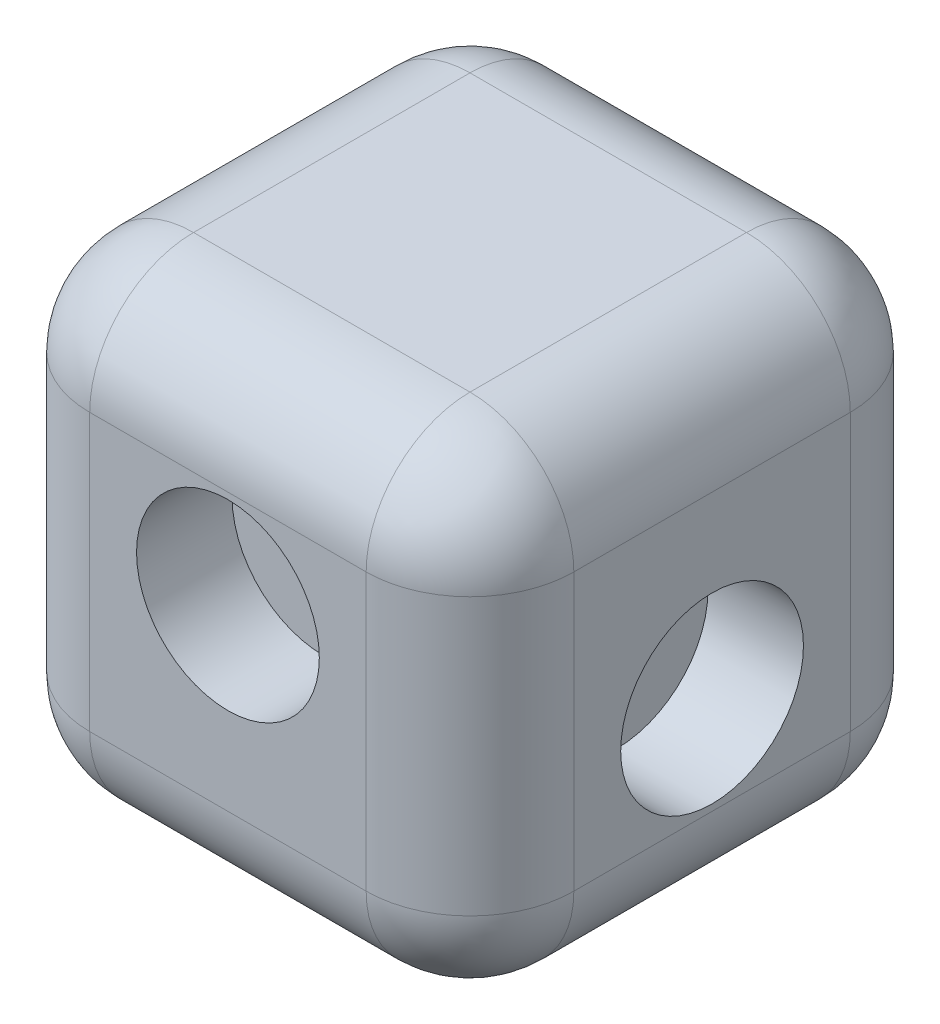
ISO-10303-21;
HEADER;
FILE_DESCRIPTION(('STEP AP214'),'2;1');
FILE_NAME('part.step','',(''),(''),'','','');
FILE_SCHEMA(('AUTOMOTIVE_DESIGN { 1 0 10303 214 1 1 1 1 }'));
ENDSEC;
DATA;
#1=APPLICATION_CONTEXT('core data for automotive mechanical design processes');
#2=APPLICATION_PROTOCOL_DEFINITION('international standard','automotive_design',2000,#1);
#3=PRODUCT_CONTEXT('',#1,'mechanical');
#4=PRODUCT('Part','Part','',(#3));
#5=PRODUCT_RELATED_PRODUCT_CATEGORY('part','',(#4));
#6=PRODUCT_DEFINITION_FORMATION('','',#4);
#7=PRODUCT_DEFINITION_CONTEXT('part definition',#1,'design');
#8=PRODUCT_DEFINITION('design','',#6,#7);
#9=PRODUCT_DEFINITION_SHAPE('','',#8);
#10=(LENGTH_UNIT() NAMED_UNIT(*) SI_UNIT(.MILLI.,.METRE.));
#11=(NAMED_UNIT(*) PLANE_ANGLE_UNIT() SI_UNIT($,.RADIAN.));
#12=(NAMED_UNIT(*) SI_UNIT($,.STERADIAN.) SOLID_ANGLE_UNIT());
#13=UNCERTAINTY_MEASURE_WITH_UNIT(LENGTH_MEASURE(1.E-05),#10,'distance_accuracy_value','');
#14=(GEOMETRIC_REPRESENTATION_CONTEXT(3) GLOBAL_UNCERTAINTY_ASSIGNED_CONTEXT((#13)) GLOBAL_UNIT_ASSIGNED_CONTEXT((#10,
#11,#12)) REPRESENTATION_CONTEXT('',''));
#15=CARTESIAN_POINT('',(0.,0.,0.));
#16=DIRECTION('',(0.,0.,1.));
#17=DIRECTION('',(1.,0.,0.));
#18=AXIS2_PLACEMENT_3D('',#15,#16,#17);
#19=CARTESIAN_POINT('',(0.,8.45184999999999,-8.45185));
#20=DIRECTION('',(-1.,0.,0.));
#21=DIRECTION('',(0.,0.,1.));
#22=AXIS2_PLACEMENT_3D('',#19,#20,#21);
#23=CYLINDRICAL_SURFACE('',#22,6.35);
#24=CARTESIAN_POINT('',(8.45184999999999,8.45184999999999,-8.45185));
#25=DIRECTION('',(1.,0.,0.));
#26=DIRECTION('',(0.,0.,-1.));
#27=AXIS2_PLACEMENT_3D('',#24,#25,#26);
#28=CIRCLE('',#27,6.35);
#29=CARTESIAN_POINT('',(8.45184999999999,8.45184999999999,-14.80185));
#30=VERTEX_POINT('',#29);
#31=CARTESIAN_POINT('',(8.45184999999999,14.80185,-8.45185));
#32=VERTEX_POINT('',#31);
#33=EDGE_CURVE('E11',#30,#32,#28,.T.);
#34=ORIENTED_EDGE('',*,*,#33,.F.);
#35=DIRECTION('',(1.,0.,0.));
#36=VECTOR('',#35,1.);
#37=CARTESIAN_POINT('',(0.,8.45184999999999,-14.80185));
#38=LINE('',#37,#36);
#39=CARTESIAN_POINT('',(-8.45185000000001,8.45184999999999,-14.80185));
#40=VERTEX_POINT('',#39);
#41=EDGE_CURVE('E207',#40,#30,#38,.T.);
#42=ORIENTED_EDGE('',*,*,#41,.F.);
#43=CARTESIAN_POINT('',(-8.45185000000001,8.45184999999999,-8.45185));
#44=DIRECTION('',(1.,0.,0.));
#45=DIRECTION('',(0.,0.,-1.));
#46=AXIS2_PLACEMENT_3D('',#43,#44,#45);
#47=CIRCLE('',#46,6.35);
#48=CARTESIAN_POINT('',(-8.45185000000001,14.80185,-8.45185));
#49=VERTEX_POINT('',#48);
#50=EDGE_CURVE('E42',#40,#49,#47,.T.);
#51=ORIENTED_EDGE('',*,*,#50,.T.);
#52=DIRECTION('',(1.,0.,0.));
#53=VECTOR('',#52,1.);
#54=CARTESIAN_POINT('',(0.,14.80185,-8.45185));
#55=LINE('',#54,#53);
#56=EDGE_CURVE('E130',#32,#49,#55,.F.);
#57=ORIENTED_EDGE('',*,*,#56,.F.);
#58=EDGE_LOOP('',(#34,#42,#51,#57));
#59=FACE_BOUND('',#58,.T.);
#60=ADVANCED_FACE('F35',(#59),#23,.T.);
#61=CARTESIAN_POINT('',(-8.45185000000001,8.45184999999999,-8.45185));
#62=DIRECTION('',(0.,0.,1.));
#63=DIRECTION('',(1.,0.,0.));
#64=AXIS2_PLACEMENT_3D('',#61,#62,#63);
#65=SPHERICAL_SURFACE('',#64,6.35);
#66=ORIENTED_EDGE('',*,*,#50,.F.);
#67=CARTESIAN_POINT('',(-8.45185,8.45184999999999,-8.45185));
#68=DIRECTION('',(0.,1.,0.));
#69=DIRECTION('',(-1.,0.,0.));
#70=AXIS2_PLACEMENT_3D('',#67,#68,#69);
#71=CIRCLE('',#70,6.35);
#72=CARTESIAN_POINT('',(-14.80185,8.45184999999999,-8.45185));
#73=VERTEX_POINT('',#72);
#74=EDGE_CURVE('E55',#40,#73,#71,.T.);
#75=ORIENTED_EDGE('',*,*,#74,.T.);
#76=CARTESIAN_POINT('',(-8.45185000000001,8.45184999999999,-8.45185));
#77=DIRECTION('',(0.,0.,1.));
#78=DIRECTION('',(1.,0.,0.));
#79=AXIS2_PLACEMENT_3D('',#76,#77,#78);
#80=CIRCLE('',#79,6.35);
#81=EDGE_CURVE('E234',#49,#73,#80,.T.);
#82=ORIENTED_EDGE('',*,*,#81,.F.);
#83=EDGE_LOOP('',(#66,#75,#82));
#84=FACE_BOUND('',#83,.T.);
#85=ADVANCED_FACE('F345',(#84),#65,.T.);
#86=CARTESIAN_POINT('',(-8.45185,0.,-8.45185));
#87=DIRECTION('',(0.,-1.,0.));
#88=DIRECTION('',(1.,0.,0.));
#89=AXIS2_PLACEMENT_3D('',#86,#87,#88);
#90=CYLINDRICAL_SURFACE('',#89,6.35);
#91=ORIENTED_EDGE('',*,*,#74,.F.);
#92=DIRECTION('',(0.,1.,0.));
#93=VECTOR('',#92,1.);
#94=CARTESIAN_POINT('',(-8.45185,0.,-14.80185));
#95=LINE('',#94,#93);
#96=CARTESIAN_POINT('',(-8.45185,-8.45185000000001,-14.80185));
#97=VERTEX_POINT('',#96);
#98=EDGE_CURVE('E210',#97,#40,#95,.T.);
#99=ORIENTED_EDGE('',*,*,#98,.F.);
#100=CARTESIAN_POINT('',(-8.45185,-8.45185000000001,-8.45185));
#101=DIRECTION('',(0.,1.,0.));
#102=DIRECTION('',(-1.,0.,0.));
#103=AXIS2_PLACEMENT_3D('',#100,#101,#102);
#104=CIRCLE('',#103,6.35);
#105=CARTESIAN_POINT('',(-14.80185,-8.45185000000001,-8.45185));
#106=VERTEX_POINT('',#105);
#107=EDGE_CURVE('E245',#97,#106,#104,.T.);
#108=ORIENTED_EDGE('',*,*,#107,.T.);
#109=DIRECTION('',(0.,1.,0.));
#110=VECTOR('',#109,1.);
#111=CARTESIAN_POINT('',(-14.80185,0.,-8.45185));
#112=LINE('',#111,#110);
#113=EDGE_CURVE('E231',#73,#106,#112,.F.);
#114=ORIENTED_EDGE('',*,*,#113,.F.);
#115=EDGE_LOOP('',(#91,#99,#108,#114));
#116=FACE_BOUND('',#115,.T.);
#117=ADVANCED_FACE('F250',(#116),#90,.T.);
#118=CARTESIAN_POINT('',(-8.45185,-8.45185000000001,-8.45185));
#119=DIRECTION('',(0.,0.,1.));
#120=DIRECTION('',(1.,0.,0.));
#121=AXIS2_PLACEMENT_3D('',#118,#119,#120);
#122=SPHERICAL_SURFACE('',#121,6.35);
#123=ORIENTED_EDGE('',*,*,#107,.F.);
#124=CARTESIAN_POINT('',(-8.45185,-8.45185000000001,-8.45185));
#125=DIRECTION('',(-1.,0.,0.));
#126=DIRECTION('',(0.,0.,1.));
#127=AXIS2_PLACEMENT_3D('',#124,#125,#126);
#128=CIRCLE('',#127,6.35);
#129=CARTESIAN_POINT('',(-8.45185,-14.80185,-8.45185));
#130=VERTEX_POINT('',#129);
#131=EDGE_CURVE('E243',#97,#130,#128,.T.);
#132=ORIENTED_EDGE('',*,*,#131,.T.);
#133=CARTESIAN_POINT('',(-8.45185,-8.45185000000001,-8.45185));
#134=DIRECTION('',(0.,0.,1.));
#135=DIRECTION('',(1.,0.,0.));
#136=AXIS2_PLACEMENT_3D('',#133,#134,#135);
#137=CIRCLE('',#136,6.35);
#138=EDGE_CURVE('E228',#106,#130,#137,.T.);
#139=ORIENTED_EDGE('',*,*,#138,.F.);
#140=EDGE_LOOP('',(#123,#132,#139));
#141=FACE_BOUND('',#140,.T.);
#142=ADVANCED_FACE('F258',(#141),#122,.T.);
#143=CARTESIAN_POINT('',(0.,-8.45185000000001,-8.45185));
#144=DIRECTION('',(1.,0.,0.));
#145=DIRECTION('',(0.,0.,-1.));
#146=AXIS2_PLACEMENT_3D('',#143,#144,#145);
#147=CYLINDRICAL_SURFACE('',#146,6.35);
#148=ORIENTED_EDGE('',*,*,#131,.F.);
#149=DIRECTION('',(-1.,0.,0.));
#150=VECTOR('',#149,1.);
#151=CARTESIAN_POINT('',(0.,-8.45185000000001,-14.80185));
#152=LINE('',#151,#150);
#153=CARTESIAN_POINT('',(8.45185,-8.45185000000001,-14.80185));
#154=VERTEX_POINT('',#153);
#155=EDGE_CURVE('E213',#154,#97,#152,.T.);
#156=ORIENTED_EDGE('',*,*,#155,.F.);
#157=CARTESIAN_POINT('',(8.45185,-8.45185000000001,-8.45185));
#158=DIRECTION('',(-1.,0.,0.));
#159=DIRECTION('',(0.,0.,1.));
#160=AXIS2_PLACEMENT_3D('',#157,#158,#159);
#161=CIRCLE('',#160,6.35);
#162=CARTESIAN_POINT('',(8.45185,-14.80185,-8.45185));
#163=VERTEX_POINT('',#162);
#164=EDGE_CURVE('E241',#154,#163,#161,.T.);
#165=ORIENTED_EDGE('',*,*,#164,.T.);
#166=DIRECTION('',(-1.,0.,0.));
#167=VECTOR('',#166,1.);
#168=CARTESIAN_POINT('',(0.,-14.80185,-8.45185));
#169=LINE('',#168,#167);
#170=EDGE_CURVE('E225',#130,#163,#169,.F.);
#171=ORIENTED_EDGE('',*,*,#170,.F.);
#172=EDGE_LOOP('',(#148,#156,#165,#171));
#173=FACE_BOUND('',#172,.T.);
#174=ADVANCED_FACE('F354',(#173),#147,.T.);
#175=CARTESIAN_POINT('',(8.45185,-8.45185,-8.45185));
#176=DIRECTION('',(0.,0.,1.));
#177=DIRECTION('',(1.,0.,0.));
#178=AXIS2_PLACEMENT_3D('',#175,#176,#177);
#179=SPHERICAL_SURFACE('',#178,6.35);
#180=ORIENTED_EDGE('',*,*,#164,.F.);
#181=CARTESIAN_POINT('',(8.45185,-8.45185,-8.45185));
#182=DIRECTION('',(0.,-1.,0.));
#183=DIRECTION('',(1.,0.,0.));
#184=AXIS2_PLACEMENT_3D('',#181,#182,#183);
#185=CIRCLE('',#184,6.35);
#186=CARTESIAN_POINT('',(14.80185,-8.45185,-8.45185));
#187=VERTEX_POINT('',#186);
#188=EDGE_CURVE('E239',#154,#187,#185,.T.);
#189=ORIENTED_EDGE('',*,*,#188,.T.);
#190=CARTESIAN_POINT('',(8.45185,-8.45185,-8.45185));
#191=DIRECTION('',(0.,0.,-1.));
#192=DIRECTION('',(-1.,0.,0.));
#193=AXIS2_PLACEMENT_3D('',#190,#191,#192);
#194=CIRCLE('',#193,6.35);
#195=EDGE_CURVE('E222',#163,#187,#194,.F.);
#196=ORIENTED_EDGE('',*,*,#195,.F.);
#197=EDGE_LOOP('',(#180,#189,#196));
#198=FACE_BOUND('',#197,.T.);
#199=ADVANCED_FACE('F389',(#198),#179,.T.);
#200=CARTESIAN_POINT('',(8.45185,0.,-8.45185));
#201=DIRECTION('',(0.,1.,0.));
#202=DIRECTION('',(-1.,0.,0.));
#203=AXIS2_PLACEMENT_3D('',#200,#201,#202);
#204=CYLINDRICAL_SURFACE('',#203,6.35);
#205=ORIENTED_EDGE('',*,*,#188,.F.);
#206=DIRECTION('',(0.,-1.,0.));
#207=VECTOR('',#206,1.);
#208=CARTESIAN_POINT('',(8.45185,0.,-14.80185));
#209=LINE('',#208,#207);
#210=EDGE_CURVE('E216',#30,#154,#209,.T.);
#211=ORIENTED_EDGE('',*,*,#210,.F.);
#212=CARTESIAN_POINT('',(8.45184999999999,8.45184999999999,-8.45185));
#213=DIRECTION('',(0.,-1.,0.));
#214=DIRECTION('',(1.,0.,0.));
#215=AXIS2_PLACEMENT_3D('',#212,#213,#214);
#216=CIRCLE('',#215,6.35);
#217=CARTESIAN_POINT('',(14.80185,8.45185,-8.45185));
#218=VERTEX_POINT('',#217);
#219=EDGE_CURVE('E237',#30,#218,#216,.T.);
#220=ORIENTED_EDGE('',*,*,#219,.T.);
#221=DIRECTION('',(0.,-1.,0.));
#222=VECTOR('',#221,1.);
#223=CARTESIAN_POINT('',(14.80185,0.,-8.45185));
#224=LINE('',#223,#222);
#225=EDGE_CURVE('E219',#187,#218,#224,.F.);
#226=ORIENTED_EDGE('',*,*,#225,.F.);
#227=EDGE_LOOP('',(#205,#211,#220,#226));
#228=FACE_BOUND('',#227,.T.);
#229=ADVANCED_FACE('F286',(#228),#204,.T.);
#230=CARTESIAN_POINT('',(8.45184999999999,8.45184999999999,-8.45185));
#231=DIRECTION('',(0.,0.,1.));
#232=DIRECTION('',(1.,0.,0.));
#233=AXIS2_PLACEMENT_3D('',#230,#231,#232);
#234=SPHERICAL_SURFACE('',#233,6.35);
#235=ORIENTED_EDGE('',*,*,#219,.F.);
#236=ORIENTED_EDGE('',*,*,#33,.T.);
#237=CARTESIAN_POINT('',(8.45184999999999,8.45184999999999,-8.45185));
#238=DIRECTION('',(0.,0.,-1.));
#239=DIRECTION('',(-1.,0.,0.));
#240=AXIS2_PLACEMENT_3D('',#237,#238,#239);
#241=CIRCLE('',#240,6.35);
#242=EDGE_CURVE('E147',#218,#32,#241,.F.);
#243=ORIENTED_EDGE('',*,*,#242,.F.);
#244=EDGE_LOOP('',(#235,#236,#243));
#245=FACE_BOUND('',#244,.T.);
#246=ADVANCED_FACE('F290',(#245),#234,.T.);
#247=CARTESIAN_POINT('',(0.,8.45184999999999,8.45185));
#248=DIRECTION('',(-1.,0.,0.));
#249=DIRECTION('',(0.,0.,1.));
#250=AXIS2_PLACEMENT_3D('',#247,#248,#249);
#251=CYLINDRICAL_SURFACE('',#250,6.35);
#252=CARTESIAN_POINT('',(-8.45185000000001,8.45184999999999,8.45185));
#253=DIRECTION('',(-1.,0.,0.));
#254=DIRECTION('',(0.,0.,1.));
#255=AXIS2_PLACEMENT_3D('',#252,#253,#254);
#256=CIRCLE('',#255,6.35);
#257=CARTESIAN_POINT('',(-8.45185000000001,8.45184999999999,14.80185));
#258=VERTEX_POINT('',#257);
#259=CARTESIAN_POINT('',(-8.45185000000001,14.80185,8.45185));
#260=VERTEX_POINT('',#259);
#261=EDGE_CURVE('E139',#258,#260,#256,.T.);
#262=ORIENTED_EDGE('',*,*,#261,.F.);
#263=DIRECTION('',(-1.,0.,0.));
#264=VECTOR('',#263,1.);
#265=CARTESIAN_POINT('',(0.,8.45184999999999,14.80185));
#266=LINE('',#265,#264);
#267=CARTESIAN_POINT('',(8.45184999999999,8.45184999999999,14.80185));
#268=VERTEX_POINT('',#267);
#269=EDGE_CURVE('E155',#268,#258,#266,.T.);
#270=ORIENTED_EDGE('',*,*,#269,.F.);
#271=CARTESIAN_POINT('',(8.45184999999999,8.45184999999999,8.45185));
#272=DIRECTION('',(-1.,0.,0.));
#273=DIRECTION('',(0.,0.,1.));
#274=AXIS2_PLACEMENT_3D('',#271,#272,#273);
#275=CIRCLE('',#274,6.35);
#276=CARTESIAN_POINT('',(8.45184999999999,14.80185,8.45185));
#277=VERTEX_POINT('',#276);
#278=EDGE_CURVE('E148',#268,#277,#275,.T.);
#279=ORIENTED_EDGE('',*,*,#278,.T.);
#280=DIRECTION('',(-1.,0.,0.));
#281=VECTOR('',#280,1.);
#282=CARTESIAN_POINT('',(-14.80185,14.80185,8.45185));
#283=LINE('',#282,#281);
#284=EDGE_CURVE('E128',#260,#277,#283,.F.);
#285=ORIENTED_EDGE('',*,*,#284,.F.);
#286=EDGE_LOOP('',(#262,#270,#279,#285));
#287=FACE_BOUND('',#286,.T.);
#288=ADVANCED_FACE('F150',(#287),#251,.T.);
#289=CARTESIAN_POINT('',(8.45184999999999,8.45184999999999,8.45185));
#290=DIRECTION('',(0.,0.,1.));
#291=DIRECTION('',(1.,0.,0.));
#292=AXIS2_PLACEMENT_3D('',#289,#290,#291);
#293=SPHERICAL_SURFACE('',#292,6.35);
#294=ORIENTED_EDGE('',*,*,#278,.F.);
#295=CARTESIAN_POINT('',(8.45184999999999,8.45184999999999,8.45185));
#296=DIRECTION('',(0.,1.,0.));
#297=DIRECTION('',(-1.,0.,0.));
#298=AXIS2_PLACEMENT_3D('',#295,#296,#297);
#299=CIRCLE('',#298,6.35);
#300=CARTESIAN_POINT('',(14.80185,8.45185,8.45185));
#301=VERTEX_POINT('',#300);
#302=EDGE_CURVE('E201',#268,#301,#299,.T.);
#303=ORIENTED_EDGE('',*,*,#302,.T.);
#304=CARTESIAN_POINT('',(8.45184999999999,8.45184999999999,8.45185));
#305=DIRECTION('',(0.,0.,-1.));
#306=DIRECTION('',(-1.,0.,0.));
#307=AXIS2_PLACEMENT_3D('',#304,#305,#306);
#308=CIRCLE('',#307,6.35);
#309=EDGE_CURVE('E151',#277,#301,#308,.T.);
#310=ORIENTED_EDGE('',*,*,#309,.F.);
#311=EDGE_LOOP('',(#294,#303,#310));
#312=FACE_BOUND('',#311,.T.);
#313=ADVANCED_FACE('F374',(#312),#293,.T.);
#314=CARTESIAN_POINT('',(8.45185,0.,8.45185));
#315=DIRECTION('',(0.,1.,0.));
#316=DIRECTION('',(-1.,0.,0.));
#317=AXIS2_PLACEMENT_3D('',#314,#315,#316);
#318=CYLINDRICAL_SURFACE('',#317,6.35);
#319=ORIENTED_EDGE('',*,*,#302,.F.);
#320=DIRECTION('',(0.,1.,0.));
#321=VECTOR('',#320,1.);
#322=CARTESIAN_POINT('',(8.45185,0.,14.80185));
#323=LINE('',#322,#321);
#324=CARTESIAN_POINT('',(8.45185,-8.45185,14.80185));
#325=VERTEX_POINT('',#324);
#326=EDGE_CURVE('E159',#325,#268,#323,.T.);
#327=ORIENTED_EDGE('',*,*,#326,.F.);
#328=CARTESIAN_POINT('',(8.45185,-8.45185,8.45185));
#329=DIRECTION('',(0.,1.,0.));
#330=DIRECTION('',(-1.,0.,0.));
#331=AXIS2_PLACEMENT_3D('',#328,#329,#330);
#332=CIRCLE('',#331,6.35);
#333=CARTESIAN_POINT('',(14.80185,-8.45185,8.45185));
#334=VERTEX_POINT('',#333);
#335=EDGE_CURVE('E199',#325,#334,#332,.T.);
#336=ORIENTED_EDGE('',*,*,#335,.T.);
#337=DIRECTION('',(0.,1.,0.));
#338=VECTOR('',#337,1.);
#339=CARTESIAN_POINT('',(14.80185,14.80185,8.45185));
#340=LINE('',#339,#338);
#341=EDGE_CURVE('E185',#301,#334,#340,.F.);
#342=ORIENTED_EDGE('',*,*,#341,.F.);
#343=EDGE_LOOP('',(#319,#327,#336,#342));
#344=FACE_BOUND('',#343,.T.);
#345=ADVANCED_FACE('F372',(#344),#318,.T.);
#346=CARTESIAN_POINT('',(8.45185,-8.45185,8.45185));
#347=DIRECTION('',(0.,0.,1.));
#348=DIRECTION('',(1.,0.,0.));
#349=AXIS2_PLACEMENT_3D('',#346,#347,#348);
#350=SPHERICAL_SURFACE('',#349,6.35);
#351=ORIENTED_EDGE('',*,*,#335,.F.);
#352=CARTESIAN_POINT('',(8.45185,-8.45185000000001,8.45185));
#353=DIRECTION('',(1.,0.,0.));
#354=DIRECTION('',(0.,0.,-1.));
#355=AXIS2_PLACEMENT_3D('',#352,#353,#354);
#356=CIRCLE('',#355,6.35);
#357=CARTESIAN_POINT('',(8.45185,-14.80185,8.45185));
#358=VERTEX_POINT('',#357);
#359=EDGE_CURVE('E196',#325,#358,#356,.T.);
#360=ORIENTED_EDGE('',*,*,#359,.T.);
#361=CARTESIAN_POINT('',(8.45185,-8.45185,8.45185));
#362=DIRECTION('',(0.,0.,-1.));
#363=DIRECTION('',(-1.,0.,0.));
#364=AXIS2_PLACEMENT_3D('',#361,#362,#363);
#365=CIRCLE('',#364,6.35);
#366=EDGE_CURVE('E182',#334,#358,#365,.T.);
#367=ORIENTED_EDGE('',*,*,#366,.F.);
#368=EDGE_LOOP('',(#351,#360,#367));
#369=FACE_BOUND('',#368,.T.);
#370=ADVANCED_FACE('F369',(#369),#350,.T.);
#371=CARTESIAN_POINT('',(0.,-8.45185000000001,8.45185));
#372=DIRECTION('',(1.,0.,0.));
#373=DIRECTION('',(0.,0.,-1.));
#374=AXIS2_PLACEMENT_3D('',#371,#372,#373);
#375=CYLINDRICAL_SURFACE('',#374,6.35);
#376=ORIENTED_EDGE('',*,*,#359,.F.);
#377=DIRECTION('',(1.,0.,0.));
#378=VECTOR('',#377,1.);
#379=CARTESIAN_POINT('',(0.,-8.45185000000001,14.80185));
#380=LINE('',#379,#378);
#381=CARTESIAN_POINT('',(-8.45185,-8.45185000000001,14.80185));
#382=VERTEX_POINT('',#381);
#383=EDGE_CURVE('E167',#382,#325,#380,.T.);
#384=ORIENTED_EDGE('',*,*,#383,.F.);
#385=CARTESIAN_POINT('',(-8.45185,-8.45185000000001,8.45185));
#386=DIRECTION('',(1.,0.,0.));
#387=DIRECTION('',(0.,0.,-1.));
#388=AXIS2_PLACEMENT_3D('',#385,#386,#387);
#389=CIRCLE('',#388,6.35);
#390=CARTESIAN_POINT('',(-8.45185,-14.80185,8.45185));
#391=VERTEX_POINT('',#390);
#392=EDGE_CURVE('E194',#382,#391,#389,.T.);
#393=ORIENTED_EDGE('',*,*,#392,.T.);
#394=DIRECTION('',(1.,0.,0.));
#395=VECTOR('',#394,1.);
#396=CARTESIAN_POINT('',(-14.80185,-14.80185,8.45185));
#397=LINE('',#396,#395);
#398=EDGE_CURVE('E179',#358,#391,#397,.F.);
#399=ORIENTED_EDGE('',*,*,#398,.F.);
#400=EDGE_LOOP('',(#376,#384,#393,#399));
#401=FACE_BOUND('',#400,.T.);
#402=ADVANCED_FACE('F367',(#401),#375,.T.);
#403=CARTESIAN_POINT('',(-8.45185,-8.45185000000001,8.45185));
#404=DIRECTION('',(0.,0.,1.));
#405=DIRECTION('',(1.,0.,0.));
#406=AXIS2_PLACEMENT_3D('',#403,#404,#405);
#407=SPHERICAL_SURFACE('',#406,6.35);
#408=ORIENTED_EDGE('',*,*,#392,.F.);
#409=CARTESIAN_POINT('',(-8.45185,-8.45185000000001,8.45185));
#410=DIRECTION('',(0.,-1.,0.));
#411=DIRECTION('',(1.,0.,0.));
#412=AXIS2_PLACEMENT_3D('',#409,#410,#411);
#413=CIRCLE('',#412,6.35);
#414=CARTESIAN_POINT('',(-14.80185,-8.45185000000001,8.45185));
#415=VERTEX_POINT('',#414);
#416=EDGE_CURVE('E191',#382,#415,#413,.T.);
#417=ORIENTED_EDGE('',*,*,#416,.T.);
#418=CARTESIAN_POINT('',(-8.45185,-8.45185000000001,8.45185));
#419=DIRECTION('',(0.,0.,1.));
#420=DIRECTION('',(1.,0.,0.));
#421=AXIS2_PLACEMENT_3D('',#418,#419,#420);
#422=CIRCLE('',#421,6.35);
#423=EDGE_CURVE('E176',#391,#415,#422,.F.);
#424=ORIENTED_EDGE('',*,*,#423,.F.);
#425=EDGE_LOOP('',(#408,#417,#424));
#426=FACE_BOUND('',#425,.T.);
#427=ADVANCED_FACE('F358',(#426),#407,.T.);
#428=CARTESIAN_POINT('',(-8.45185,0.,8.45185));
#429=DIRECTION('',(0.,-1.,0.));
#430=DIRECTION('',(1.,0.,0.));
#431=AXIS2_PLACEMENT_3D('',#428,#429,#430);
#432=CYLINDRICAL_SURFACE('',#431,6.35);
#433=ORIENTED_EDGE('',*,*,#416,.F.);
#434=DIRECTION('',(0.,-1.,0.));
#435=VECTOR('',#434,1.);
#436=CARTESIAN_POINT('',(-8.45185,0.,14.80185));
#437=LINE('',#436,#435);
#438=EDGE_CURVE('E170',#258,#382,#437,.T.);
#439=ORIENTED_EDGE('',*,*,#438,.F.);
#440=CARTESIAN_POINT('',(-8.45185,8.45184999999999,8.45185));
#441=DIRECTION('',(0.,-1.,0.));
#442=DIRECTION('',(1.,0.,0.));
#443=AXIS2_PLACEMENT_3D('',#440,#441,#442);
#444=CIRCLE('',#443,6.35);
#445=CARTESIAN_POINT('',(-14.80185,8.45184999999999,8.45185));
#446=VERTEX_POINT('',#445);
#447=EDGE_CURVE('E143',#258,#446,#444,.T.);
#448=ORIENTED_EDGE('',*,*,#447,.T.);
#449=DIRECTION('',(0.,-1.,0.));
#450=VECTOR('',#449,1.);
#451=CARTESIAN_POINT('',(-14.80185,14.80185,8.45185));
#452=LINE('',#451,#450);
#453=EDGE_CURVE('E173',#415,#446,#452,.F.);
#454=ORIENTED_EDGE('',*,*,#453,.F.);
#455=EDGE_LOOP('',(#433,#439,#448,#454));
#456=FACE_BOUND('',#455,.T.);
#457=ADVANCED_FACE('F361',(#456),#432,.T.);
#458=CARTESIAN_POINT('',(-8.45185000000001,8.45184999999999,8.45185));
#459=DIRECTION('',(0.,0.,1.));
#460=DIRECTION('',(1.,0.,0.));
#461=AXIS2_PLACEMENT_3D('',#458,#459,#460);
#462=SPHERICAL_SURFACE('',#461,6.35);
#463=ORIENTED_EDGE('',*,*,#447,.F.);
#464=ORIENTED_EDGE('',*,*,#261,.T.);
#465=CARTESIAN_POINT('',(-8.45185000000001,8.45184999999999,8.45185));
#466=DIRECTION('',(0.,0.,1.));
#467=DIRECTION('',(1.,0.,0.));
#468=AXIS2_PLACEMENT_3D('',#465,#466,#467);
#469=CIRCLE('',#468,6.35);
#470=EDGE_CURVE('E141',#446,#260,#469,.F.);
#471=ORIENTED_EDGE('',*,*,#470,.F.);
#472=EDGE_LOOP('',(#463,#464,#471));
#473=FACE_BOUND('',#472,.T.);
#474=ADVANCED_FACE('F140',(#473),#462,.T.);
#475=CARTESIAN_POINT('',(8.45185,-8.45185,-14.80185));
#476=DIRECTION('',(0.,0.,-1.));
#477=DIRECTION('',(-1.,0.,0.));
#478=AXIS2_PLACEMENT_3D('',#475,#476,#477);
#479=CYLINDRICAL_SURFACE('',#478,6.35);
#480=DIRECTION('',(0.,0.,-1.));
#481=VECTOR('',#480,1.);
#482=CARTESIAN_POINT('',(8.45185,-14.80185,-14.80185));
#483=LINE('',#482,#481);
#484=EDGE_CURVE('E156',#163,#358,#483,.F.);
#485=ORIENTED_EDGE('',*,*,#484,.F.);
#486=ORIENTED_EDGE('',*,*,#195,.T.);
#487=DIRECTION('',(0.,0.,-1.));
#488=VECTOR('',#487,1.);
#489=CARTESIAN_POINT('',(14.80185,-8.45185,-14.80185));
#490=LINE('',#489,#488);
#491=EDGE_CURVE('E161',#334,#187,#490,.T.);
#492=ORIENTED_EDGE('',*,*,#491,.F.);
#493=ORIENTED_EDGE('',*,*,#366,.T.);
#494=EDGE_LOOP('',(#485,#486,#492,#493));
#495=FACE_BOUND('',#494,.T.);
#496=ADVANCED_FACE('F280',(#495),#479,.T.);
#497=CARTESIAN_POINT('',(-8.45185,-8.45185000000001,-14.80185));
#498=DIRECTION('',(0.,0.,1.));
#499=DIRECTION('',(1.,0.,0.));
#500=AXIS2_PLACEMENT_3D('',#497,#498,#499);
#501=CYLINDRICAL_SURFACE('',#500,6.35);
#502=DIRECTION('',(0.,0.,1.));
#503=VECTOR('',#502,1.);
#504=CARTESIAN_POINT('',(-14.80185,-8.45185000000001,-14.80185));
#505=LINE('',#504,#503);
#506=EDGE_CURVE('E257',#106,#415,#505,.T.);
#507=ORIENTED_EDGE('',*,*,#506,.F.);
#508=ORIENTED_EDGE('',*,*,#138,.T.);
#509=DIRECTION('',(0.,0.,1.));
#510=VECTOR('',#509,1.);
#511=CARTESIAN_POINT('',(-8.45185,-14.80185,-14.80185));
#512=LINE('',#511,#510);
#513=EDGE_CURVE('E265',#391,#130,#512,.F.);
#514=ORIENTED_EDGE('',*,*,#513,.F.);
#515=ORIENTED_EDGE('',*,*,#423,.T.);
#516=EDGE_LOOP('',(#507,#508,#514,#515));
#517=FACE_BOUND('',#516,.T.);
#518=ADVANCED_FACE('F262',(#517),#501,.T.);
#519=CARTESIAN_POINT('',(-8.45185000000001,8.45184999999999,-14.80185));
#520=DIRECTION('',(0.,0.,1.));
#521=DIRECTION('',(1.,0.,0.));
#522=AXIS2_PLACEMENT_3D('',#519,#520,#521);
#523=CYLINDRICAL_SURFACE('',#522,6.35);
#524=DIRECTION('',(0.,0.,1.));
#525=VECTOR('',#524,1.);
#526=CARTESIAN_POINT('',(-8.45185000000001,14.80185,-14.80185));
#527=LINE('',#526,#525);
#528=EDGE_CURVE('E123',#49,#260,#527,.T.);
#529=ORIENTED_EDGE('',*,*,#528,.F.);
#530=ORIENTED_EDGE('',*,*,#81,.T.);
#531=DIRECTION('',(0.,0.,1.));
#532=VECTOR('',#531,1.);
#533=CARTESIAN_POINT('',(-14.80185,8.45184999999999,-14.80185));
#534=LINE('',#533,#532);
#535=EDGE_CURVE('E133',#446,#73,#534,.F.);
#536=ORIENTED_EDGE('',*,*,#535,.F.);
#537=ORIENTED_EDGE('',*,*,#470,.T.);
#538=EDGE_LOOP('',(#529,#530,#536,#537));
#539=FACE_BOUND('',#538,.T.);
#540=ADVANCED_FACE('F153',(#539),#523,.T.);
#541=CARTESIAN_POINT('',(8.45184999999999,8.45184999999999,-14.80185));
#542=DIRECTION('',(0.,0.,-1.));
#543=DIRECTION('',(-1.,0.,0.));
#544=AXIS2_PLACEMENT_3D('',#541,#542,#543);
#545=CYLINDRICAL_SURFACE('',#544,6.35);
#546=DIRECTION('',(0.,0.,-1.));
#547=VECTOR('',#546,1.);
#548=CARTESIAN_POINT('',(14.80185,8.45185,-14.80185));
#549=LINE('',#548,#547);
#550=EDGE_CURVE('E134',#218,#301,#549,.F.);
#551=ORIENTED_EDGE('',*,*,#550,.F.);
#552=ORIENTED_EDGE('',*,*,#242,.T.);
#553=DIRECTION('',(0.,0.,-1.));
#554=VECTOR('',#553,1.);
#555=CARTESIAN_POINT('',(8.45184999999999,14.80185,-14.80185));
#556=LINE('',#555,#554);
#557=EDGE_CURVE('E295',#277,#32,#556,.T.);
#558=ORIENTED_EDGE('',*,*,#557,.F.);
#559=ORIENTED_EDGE('',*,*,#309,.T.);
#560=EDGE_LOOP('',(#551,#552,#558,#559));
#561=FACE_BOUND('',#560,.T.);
#562=ADVANCED_FACE('F294',(#561),#545,.T.);
#563=CARTESIAN_POINT('',(14.80185,14.80185,-14.80185));
#564=DIRECTION('',(1.,0.,0.));
#565=DIRECTION('',(0.,1.,0.));
#566=AXIS2_PLACEMENT_3D('',#563,#564,#565);
#567=PLANE('',#566);
#568=CARTESIAN_POINT('',(14.80185,-2.47015,0.));
#569=DIRECTION('',(1.,0.,0.));
#570=DIRECTION('',(0.,1.,0.));
#571=AXIS2_PLACEMENT_3D('',#568,#569,#570);
#572=CIRCLE('',#571,5.588);
#573=CARTESIAN_POINT('',(14.80185,3.11785,0.));
#574=VERTEX_POINT('',#573);
#575=EDGE_CURVE('E318',#574,#574,#572,.T.);
#576=ORIENTED_EDGE('',*,*,#575,.F.);
#577=EDGE_LOOP('',(#576));
#578=FACE_BOUND('',#577,.T.);
#579=ORIENTED_EDGE('',*,*,#491,.T.);
#580=ORIENTED_EDGE('',*,*,#225,.T.);
#581=ORIENTED_EDGE('',*,*,#550,.T.);
#582=ORIENTED_EDGE('',*,*,#341,.T.);
#583=EDGE_LOOP('',(#579,#580,#581,#582));
#584=FACE_BOUND('',#583,.T.);
#585=ADVANCED_FACE('F273',(#578,#584),#567,.T.);
#586=CARTESIAN_POINT('',(-14.80185,-14.80185,-14.80185));
#587=DIRECTION('',(0.,-1.,0.));
#588=DIRECTION('',(0.,0.,-1.));
#589=AXIS2_PLACEMENT_3D('',#586,#587,#588);
#590=PLANE('',#589);
#591=ORIENTED_EDGE('',*,*,#513,.T.);
#592=ORIENTED_EDGE('',*,*,#170,.T.);
#593=ORIENTED_EDGE('',*,*,#484,.T.);
#594=ORIENTED_EDGE('',*,*,#398,.T.);
#595=EDGE_LOOP('',(#591,#592,#593,#594));
#596=FACE_BOUND('',#595,.T.);
#597=ADVANCED_FACE('F334',(#596),#590,.T.);
#598=CARTESIAN_POINT('',(-14.80185,14.80185,-14.80185));
#599=DIRECTION('',(-1.,0.,0.));
#600=DIRECTION('',(0.,-1.,0.));
#601=AXIS2_PLACEMENT_3D('',#598,#599,#600);
#602=PLANE('',#601);
#603=CARTESIAN_POINT('',(-14.80185,-2.47015000000001,0.));
#604=DIRECTION('',(-1.,0.,0.));
#605=DIRECTION('',(0.,-1.,0.));
#606=AXIS2_PLACEMENT_3D('',#603,#604,#605);
#607=CIRCLE('',#606,5.588);
#608=CARTESIAN_POINT('',(-14.80185,-8.05815000000001,0.));
#609=VERTEX_POINT('',#608);
#610=EDGE_CURVE('E312',#609,#609,#607,.T.);
#611=ORIENTED_EDGE('',*,*,#610,.F.);
#612=EDGE_LOOP('',(#611));
#613=FACE_BOUND('',#612,.T.);
#614=ORIENTED_EDGE('',*,*,#535,.T.);
#615=ORIENTED_EDGE('',*,*,#113,.T.);
#616=ORIENTED_EDGE('',*,*,#506,.T.);
#617=ORIENTED_EDGE('',*,*,#453,.T.);
#618=EDGE_LOOP('',(#614,#615,#616,#617));
#619=FACE_BOUND('',#618,.T.);
#620=ADVANCED_FACE('F255',(#613,#619),#602,.T.);
#621=CARTESIAN_POINT('',(-14.80185,14.80185,-14.80185));
#622=DIRECTION('',(0.,1.,0.));
#623=DIRECTION('',(0.,0.,1.));
#624=AXIS2_PLACEMENT_3D('',#621,#622,#623);
#625=PLANE('',#624);
#626=ORIENTED_EDGE('',*,*,#557,.T.);
#627=ORIENTED_EDGE('',*,*,#56,.T.);
#628=ORIENTED_EDGE('',*,*,#528,.T.);
#629=ORIENTED_EDGE('',*,*,#284,.T.);
#630=EDGE_LOOP('',(#626,#627,#628,#629));
#631=FACE_BOUND('',#630,.T.);
#632=ADVANCED_FACE('F126',(#631),#625,.T.);
#633=CARTESIAN_POINT('',(0.,0.,-14.80185));
#634=DIRECTION('',(0.,0.,1.));
#635=DIRECTION('',(1.,0.,0.));
#636=AXIS2_PLACEMENT_3D('',#633,#634,#635);
#637=PLANE('',#636);
#638=ORIENTED_EDGE('',*,*,#41,.T.);
#639=ORIENTED_EDGE('',*,*,#210,.T.);
#640=ORIENTED_EDGE('',*,*,#155,.T.);
#641=ORIENTED_EDGE('',*,*,#98,.T.);
#642=EDGE_LOOP('',(#638,#639,#640,#641));
#643=FACE_BOUND('',#642,.T.);
#644=CARTESIAN_POINT('',(0.,2.47014999999999,-14.80185));
#645=DIRECTION('',(0.,0.,-1.));
#646=DIRECTION('',(-1.,0.,0.));
#647=AXIS2_PLACEMENT_3D('',#644,#645,#646);
#648=CIRCLE('',#647,5.588);
#649=CARTESIAN_POINT('',(-5.588,2.47014999999999,-14.80185));
#650=VERTEX_POINT('',#649);
#651=EDGE_CURVE('E300',#650,#650,#648,.T.);
#652=ORIENTED_EDGE('',*,*,#651,.F.);
#653=EDGE_LOOP('',(#652));
#654=FACE_BOUND('',#653,.T.);
#655=ADVANCED_FACE('F350',(#643,#654),#637,.F.);
#656=CARTESIAN_POINT('',(0.,0.,14.80185));
#657=DIRECTION('',(0.,0.,1.));
#658=DIRECTION('',(1.,0.,0.));
#659=AXIS2_PLACEMENT_3D('',#656,#657,#658);
#660=PLANE('',#659);
#661=ORIENTED_EDGE('',*,*,#269,.T.);
#662=ORIENTED_EDGE('',*,*,#438,.T.);
#663=ORIENTED_EDGE('',*,*,#383,.T.);
#664=ORIENTED_EDGE('',*,*,#326,.T.);
#665=EDGE_LOOP('',(#661,#662,#663,#664));
#666=FACE_BOUND('',#665,.T.);
#667=CARTESIAN_POINT('',(0.,2.47014999999999,14.80185));
#668=DIRECTION('',(0.,0.,1.));
#669=DIRECTION('',(1.,0.,0.));
#670=AXIS2_PLACEMENT_3D('',#667,#668,#669);
#671=CIRCLE('',#670,5.588);
#672=CARTESIAN_POINT('',(5.588,2.47014999999999,14.80185));
#673=VERTEX_POINT('',#672);
#674=EDGE_CURVE('E306',#673,#673,#671,.T.);
#675=ORIENTED_EDGE('',*,*,#674,.F.);
#676=EDGE_LOOP('',(#675));
#677=FACE_BOUND('',#676,.T.);
#678=ADVANCED_FACE('F364',(#666,#677),#660,.T.);
#679=CARTESIAN_POINT('',(0.,2.47014999999999,-8.95985));
#680=DIRECTION('',(0.,0.,-1.));
#681=DIRECTION('',(-1.,0.,0.));
#682=AXIS2_PLACEMENT_3D('',#679,#680,#681);
#683=CYLINDRICAL_SURFACE('',#682,5.588);
#684=CARTESIAN_POINT('',(0.,2.47014999999999,-8.95985));
#685=DIRECTION('',(0.,0.,-1.));
#686=DIRECTION('',(-1.,0.,0.));
#687=AXIS2_PLACEMENT_3D('',#684,#685,#686);
#688=CIRCLE('',#687,5.588);
#689=CARTESIAN_POINT('',(-5.588,2.47014999999999,-8.95985));
#690=VERTEX_POINT('',#689);
#691=EDGE_CURVE('E297',#690,#690,#688,.T.);
#692=ORIENTED_EDGE('',*,*,#691,.F.);
#693=EDGE_LOOP('',(#692));
#694=FACE_BOUND('',#693,.T.);
#695=ORIENTED_EDGE('',*,*,#651,.T.);
#696=EDGE_LOOP('',(#695));
#697=FACE_BOUND('',#696,.T.);
#698=ADVANCED_FACE('F490',(#694,#697),#683,.F.);
#699=CARTESIAN_POINT('',(0.,2.47014999999999,-8.95985));
#700=DIRECTION('',(0.,0.,-1.));
#701=DIRECTION('',(-1.,0.,0.));
#702=AXIS2_PLACEMENT_3D('',#699,#700,#701);
#703=PLANE('',#702);
#704=ORIENTED_EDGE('',*,*,#691,.T.);
#705=EDGE_LOOP('',(#704));
#706=FACE_BOUND('',#705,.T.);
#707=ADVANCED_FACE('F524',(#706),#703,.T.);
#708=CARTESIAN_POINT('',(0.,2.47014999999999,8.95985));
#709=DIRECTION('',(0.,0.,1.));
#710=DIRECTION('',(1.,0.,0.));
#711=AXIS2_PLACEMENT_3D('',#708,#709,#710);
#712=CYLINDRICAL_SURFACE('',#711,5.588);
#713=CARTESIAN_POINT('',(0.,2.47014999999999,8.95985));
#714=DIRECTION('',(0.,0.,1.));
#715=DIRECTION('',(1.,0.,0.));
#716=AXIS2_PLACEMENT_3D('',#713,#714,#715);
#717=CIRCLE('',#716,5.588);
#718=CARTESIAN_POINT('',(5.588,2.47014999999999,8.95985));
#719=VERTEX_POINT('',#718);
#720=EDGE_CURVE('E303',#719,#719,#717,.T.);
#721=ORIENTED_EDGE('',*,*,#720,.F.);
#722=EDGE_LOOP('',(#721));
#723=FACE_BOUND('',#722,.T.);
#724=ORIENTED_EDGE('',*,*,#674,.T.);
#725=EDGE_LOOP('',(#724));
#726=FACE_BOUND('',#725,.T.);
#727=ADVANCED_FACE('F532',(#723,#726),#712,.F.);
#728=CARTESIAN_POINT('',(0.,2.47014999999999,8.95985));
#729=DIRECTION('',(0.,0.,1.));
#730=DIRECTION('',(1.,0.,0.));
#731=AXIS2_PLACEMENT_3D('',#728,#729,#730);
#732=PLANE('',#731);
#733=ORIENTED_EDGE('',*,*,#720,.T.);
#734=EDGE_LOOP('',(#733));
#735=FACE_BOUND('',#734,.T.);
#736=ADVANCED_FACE('F540',(#735),#732,.T.);
#737=CARTESIAN_POINT('',(-8.95985,-2.47015000000001,0.));
#738=DIRECTION('',(-1.,0.,0.));
#739=DIRECTION('',(0.,-1.,0.));
#740=AXIS2_PLACEMENT_3D('',#737,#738,#739);
#741=CYLINDRICAL_SURFACE('',#740,5.588);
#742=CARTESIAN_POINT('',(-8.95985,-2.47015000000001,0.));
#743=DIRECTION('',(-1.,0.,0.));
#744=DIRECTION('',(0.,-1.,0.));
#745=AXIS2_PLACEMENT_3D('',#742,#743,#744);
#746=CIRCLE('',#745,5.588);
#747=CARTESIAN_POINT('',(-8.95985,-8.05815000000001,0.));
#748=VERTEX_POINT('',#747);
#749=EDGE_CURVE('E309',#748,#748,#746,.T.);
#750=ORIENTED_EDGE('',*,*,#749,.F.);
#751=EDGE_LOOP('',(#750));
#752=FACE_BOUND('',#751,.T.);
#753=ORIENTED_EDGE('',*,*,#610,.T.);
#754=EDGE_LOOP('',(#753));
#755=FACE_BOUND('',#754,.T.);
#756=ADVANCED_FACE('F548',(#752,#755),#741,.F.);
#757=CARTESIAN_POINT('',(-8.95985,-2.47015000000001,0.));
#758=DIRECTION('',(-1.,0.,0.));
#759=DIRECTION('',(0.,-1.,0.));
#760=AXIS2_PLACEMENT_3D('',#757,#758,#759);
#761=PLANE('',#760);
#762=ORIENTED_EDGE('',*,*,#749,.T.);
#763=EDGE_LOOP('',(#762));
#764=FACE_BOUND('',#763,.T.);
#765=ADVANCED_FACE('F329',(#764),#761,.T.);
#766=CARTESIAN_POINT('',(8.95985,-2.47015000000001,0.));
#767=DIRECTION('',(1.,0.,0.));
#768=DIRECTION('',(0.,1.,0.));
#769=AXIS2_PLACEMENT_3D('',#766,#767,#768);
#770=CYLINDRICAL_SURFACE('',#769,5.588);
#771=CARTESIAN_POINT('',(8.95985,-2.47015000000001,0.));
#772=DIRECTION('',(1.,0.,0.));
#773=DIRECTION('',(0.,1.,0.));
#774=AXIS2_PLACEMENT_3D('',#771,#772,#773);
#775=CIRCLE('',#774,5.588);
#776=CARTESIAN_POINT('',(8.95985,3.11784999999999,0.));
#777=VERTEX_POINT('',#776);
#778=EDGE_CURVE('E315',#777,#777,#775,.T.);
#779=ORIENTED_EDGE('',*,*,#778,.F.);
#780=EDGE_LOOP('',(#779));
#781=FACE_BOUND('',#780,.T.);
#782=ORIENTED_EDGE('',*,*,#575,.T.);
#783=EDGE_LOOP('',(#782));
#784=FACE_BOUND('',#783,.T.);
#785=ADVANCED_FACE('F326',(#781,#784),#770,.F.);
#786=CARTESIAN_POINT('',(8.95985,-2.47015000000001,0.));
#787=DIRECTION('',(1.,0.,0.));
#788=DIRECTION('',(0.,1.,0.));
#789=AXIS2_PLACEMENT_3D('',#786,#787,#788);
#790=PLANE('',#789);
#791=ORIENTED_EDGE('',*,*,#778,.T.);
#792=EDGE_LOOP('',(#791));
#793=FACE_BOUND('',#792,.T.);
#794=ADVANCED_FACE('F324',(#793),#790,.T.);
#795=CLOSED_SHELL('',(#60,#85,#117,#142,#174,#199,#229,#246,#288,#313,#345,#370,#402,#427,#457,
#474,#496,#518,#540,#562,#585,#597,#620,#632,#655,#678,#698,#707,#727,#736,#756,#765,#785,#794));
#796=MANIFOLD_SOLID_BREP('B2',#795);
#797=ADVANCED_BREP_SHAPE_REPRESENTATION('',(#18,#796),#14);
#798=SHAPE_DEFINITION_REPRESENTATION(#9,#797);
ENDSEC;
END-ISO-10303-21;
